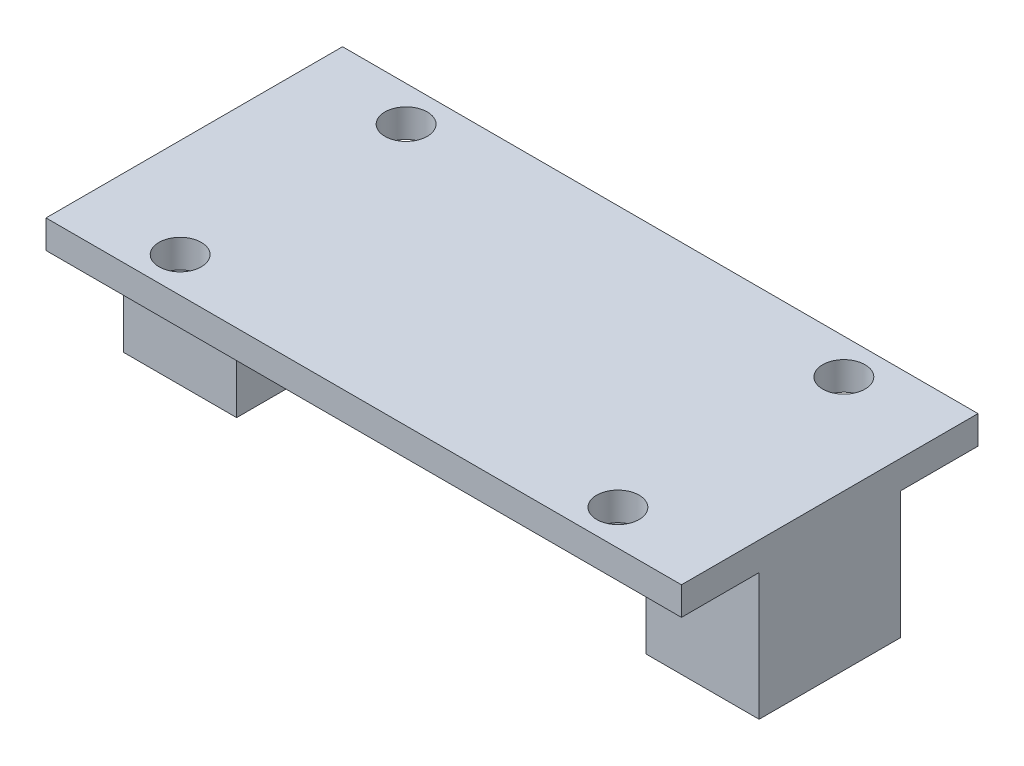
ISO-10303-21;
HEADER;
FILE_DESCRIPTION(('STEP AP214'),'2;1');
FILE_NAME('part.step','',(''),(''),'','','');
FILE_SCHEMA(('AUTOMOTIVE_DESIGN { 1 0 10303 214 1 1 1 1 }'));
ENDSEC;
DATA;
#1=APPLICATION_CONTEXT('core data for automotive mechanical design processes');
#2=APPLICATION_PROTOCOL_DEFINITION('international standard','automotive_design',2000,#1);
#3=PRODUCT_CONTEXT('',#1,'mechanical');
#4=PRODUCT('Part','Part','',(#3));
#5=PRODUCT_RELATED_PRODUCT_CATEGORY('part','',(#4));
#6=PRODUCT_DEFINITION_FORMATION('','',#4);
#7=PRODUCT_DEFINITION_CONTEXT('part definition',#1,'design');
#8=PRODUCT_DEFINITION('design','',#6,#7);
#9=PRODUCT_DEFINITION_SHAPE('','',#8);
#10=(LENGTH_UNIT() NAMED_UNIT(*) SI_UNIT(.MILLI.,.METRE.));
#11=(NAMED_UNIT(*) PLANE_ANGLE_UNIT() SI_UNIT($,.RADIAN.));
#12=(NAMED_UNIT(*) SI_UNIT($,.STERADIAN.) SOLID_ANGLE_UNIT());
#13=UNCERTAINTY_MEASURE_WITH_UNIT(LENGTH_MEASURE(1.E-05),#10,'distance_accuracy_value','');
#14=(GEOMETRIC_REPRESENTATION_CONTEXT(3) GLOBAL_UNCERTAINTY_ASSIGNED_CONTEXT((#13)) GLOBAL_UNIT_ASSIGNED_CONTEXT((#10,
#11,#12)) REPRESENTATION_CONTEXT('',''));
#15=CARTESIAN_POINT('',(0.,0.,0.));
#16=DIRECTION('',(0.,0.,1.));
#17=DIRECTION('',(1.,0.,0.));
#18=AXIS2_PLACEMENT_3D('',#15,#16,#17);
#19=CARTESIAN_POINT('',(17.5,0.,10.));
#20=DIRECTION('',(0.,1.,0.));
#21=DIRECTION('',(-1.,0.,0.));
#22=AXIS2_PLACEMENT_3D('',#19,#20,#21);
#23=PLANE('',#22);
#24=DIRECTION('',(1.,0.,0.));
#25=VECTOR('',#24,1.);
#26=CARTESIAN_POINT('',(17.5,0.,0.));
#27=LINE('',#26,#25);
#28=CARTESIAN_POINT('',(-17.5,0.,0.));
#29=VERTEX_POINT('',#28);
#30=CARTESIAN_POINT('',(17.5,0.,0.));
#31=VERTEX_POINT('',#30);
#32=EDGE_CURVE('E163',#29,#31,#27,.T.);
#33=ORIENTED_EDGE('',*,*,#32,.T.);
#34=DIRECTION('',(0.,0.,-1.));
#35=VECTOR('',#34,1.);
#36=CARTESIAN_POINT('',(17.5,0.,10.));
#37=LINE('',#36,#35);
#38=CARTESIAN_POINT('',(17.5,0.,10.));
#39=VERTEX_POINT('',#38);
#40=EDGE_CURVE('E11',#39,#31,#37,.T.);
#41=ORIENTED_EDGE('',*,*,#40,.F.);
#42=DIRECTION('',(1.,0.,0.));
#43=VECTOR('',#42,1.);
#44=CARTESIAN_POINT('',(17.5,0.,10.));
#45=LINE('',#44,#43);
#46=CARTESIAN_POINT('',(-17.5,0.,10.));
#47=VERTEX_POINT('',#46);
#48=EDGE_CURVE('E200',#47,#39,#45,.T.);
#49=ORIENTED_EDGE('',*,*,#48,.F.);
#50=DIRECTION('',(0.,0.,-1.));
#51=VECTOR('',#50,1.);
#52=CARTESIAN_POINT('',(-17.5,0.,10.));
#53=LINE('',#52,#51);
#54=EDGE_CURVE('E159',#47,#29,#53,.T.);
#55=ORIENTED_EDGE('',*,*,#54,.T.);
#56=EDGE_LOOP('',(#33,#41,#49,#55));
#57=FACE_BOUND('',#56,.T.);
#58=ADVANCED_FACE('F42',(#57),#23,.F.);
#59=CARTESIAN_POINT('',(17.5,-1.,10.));
#60=DIRECTION('',(1.,0.,0.));
#61=DIRECTION('',(0.,0.,-1.));
#62=AXIS2_PLACEMENT_3D('',#59,#60,#61);
#63=PLANE('',#62);
#64=DIRECTION('',(0.,-1.,0.));
#65=VECTOR('',#64,1.);
#66=CARTESIAN_POINT('',(17.5,-1.,0.));
#67=LINE('',#66,#65);
#68=CARTESIAN_POINT('',(17.5,-1.,0.));
#69=VERTEX_POINT('',#68);
#70=EDGE_CURVE('E167',#31,#69,#67,.T.);
#71=ORIENTED_EDGE('',*,*,#70,.T.);
#72=DIRECTION('',(0.,0.,-1.));
#73=VECTOR('',#72,1.);
#74=CARTESIAN_POINT('',(17.5,-1.,10.));
#75=LINE('',#74,#73);
#76=CARTESIAN_POINT('',(17.5,-1.,10.));
#77=VERTEX_POINT('',#76);
#78=EDGE_CURVE('E52',#77,#69,#75,.T.);
#79=ORIENTED_EDGE('',*,*,#78,.F.);
#80=DIRECTION('',(0.,-1.,0.));
#81=VECTOR('',#80,1.);
#82=CARTESIAN_POINT('',(17.5,-1.,10.));
#83=LINE('',#82,#81);
#84=EDGE_CURVE('E111',#39,#77,#83,.T.);
#85=ORIENTED_EDGE('',*,*,#84,.F.);
#86=ORIENTED_EDGE('',*,*,#40,.T.);
#87=EDGE_LOOP('',(#71,#79,#85,#86));
#88=FACE_BOUND('',#87,.T.);
#89=ADVANCED_FACE('F405',(#88),#63,.F.);
#90=CARTESIAN_POINT('',(14.5,-1.,10.));
#91=DIRECTION('',(0.,-1.,0.));
#92=DIRECTION('',(0.,0.,-1.));
#93=AXIS2_PLACEMENT_3D('',#90,#91,#92);
#94=PLANE('',#93);
#95=DIRECTION('',(-1.,0.,0.));
#96=VECTOR('',#95,1.);
#97=CARTESIAN_POINT('',(14.5,-1.,0.));
#98=LINE('',#97,#96);
#99=CARTESIAN_POINT('',(14.5,-1.,0.));
#100=VERTEX_POINT('',#99);
#101=EDGE_CURVE('E171',#69,#100,#98,.T.);
#102=ORIENTED_EDGE('',*,*,#101,.T.);
#103=DIRECTION('',(0.,0.,-1.));
#104=VECTOR('',#103,1.);
#105=CARTESIAN_POINT('',(14.5,-1.,10.));
#106=LINE('',#105,#104);
#107=CARTESIAN_POINT('',(14.5,-1.,10.));
#108=VERTEX_POINT('',#107);
#109=EDGE_CURVE('E219',#108,#100,#106,.T.);
#110=ORIENTED_EDGE('',*,*,#109,.F.);
#111=DIRECTION('',(-1.,0.,0.));
#112=VECTOR('',#111,1.);
#113=CARTESIAN_POINT('',(14.5,-1.,10.));
#114=LINE('',#113,#112);
#115=EDGE_CURVE('E308',#77,#108,#114,.T.);
#116=ORIENTED_EDGE('',*,*,#115,.F.);
#117=ORIENTED_EDGE('',*,*,#78,.T.);
#118=EDGE_LOOP('',(#102,#110,#116,#117));
#119=FACE_BOUND('',#118,.T.);
#120=ADVANCED_FACE('F403',(#119),#94,.F.);
#121=CARTESIAN_POINT('',(14.5,-5.,10.));
#122=DIRECTION('',(1.,0.,0.));
#123=DIRECTION('',(0.,0.,-1.));
#124=AXIS2_PLACEMENT_3D('',#121,#122,#123);
#125=PLANE('',#124);
#126=DIRECTION('',(0.,-1.,0.));
#127=VECTOR('',#126,1.);
#128=CARTESIAN_POINT('',(14.5,-5.,0.));
#129=LINE('',#128,#127);
#130=CARTESIAN_POINT('',(14.5,-5.,0.));
#131=VERTEX_POINT('',#130);
#132=EDGE_CURVE('E174',#100,#131,#129,.T.);
#133=ORIENTED_EDGE('',*,*,#132,.T.);
#134=DIRECTION('',(0.,0.,-1.));
#135=VECTOR('',#134,1.);
#136=CARTESIAN_POINT('',(14.5,-5.,10.));
#137=LINE('',#136,#135);
#138=CARTESIAN_POINT('',(14.5,-5.,10.));
#139=VERTEX_POINT('',#138);
#140=EDGE_CURVE('E215',#139,#131,#137,.T.);
#141=ORIENTED_EDGE('',*,*,#140,.F.);
#142=DIRECTION('',(0.,-1.,0.));
#143=VECTOR('',#142,1.);
#144=CARTESIAN_POINT('',(14.5,-5.,10.));
#145=LINE('',#144,#143);
#146=EDGE_CURVE('E311',#108,#139,#145,.T.);
#147=ORIENTED_EDGE('',*,*,#146,.F.);
#148=ORIENTED_EDGE('',*,*,#109,.T.);
#149=EDGE_LOOP('',(#133,#141,#147,#148));
#150=FACE_BOUND('',#149,.T.);
#151=ADVANCED_FACE('F399',(#150),#125,.F.);
#152=CARTESIAN_POINT('',(22.5,-5.,10.));
#153=DIRECTION('',(0.,1.,0.));
#154=DIRECTION('',(-1.,0.,0.));
#155=AXIS2_PLACEMENT_3D('',#152,#153,#154);
#156=PLANE('',#155);
#157=DIRECTION('',(1.,0.,0.));
#158=VECTOR('',#157,1.);
#159=CARTESIAN_POINT('',(22.5,-5.,0.));
#160=LINE('',#159,#158);
#161=CARTESIAN_POINT('',(22.5,-5.,0.));
#162=VERTEX_POINT('',#161);
#163=EDGE_CURVE('E177',#131,#162,#160,.T.);
#164=ORIENTED_EDGE('',*,*,#163,.T.);
#165=DIRECTION('',(0.,0.,-1.));
#166=VECTOR('',#165,1.);
#167=CARTESIAN_POINT('',(22.5,-5.,10.));
#168=LINE('',#167,#166);
#169=CARTESIAN_POINT('',(22.5,-5.,10.));
#170=VERTEX_POINT('',#169);
#171=EDGE_CURVE('E211',#170,#162,#168,.T.);
#172=ORIENTED_EDGE('',*,*,#171,.F.);
#173=DIRECTION('',(1.,0.,0.));
#174=VECTOR('',#173,1.);
#175=CARTESIAN_POINT('',(22.5,-5.,10.));
#176=LINE('',#175,#174);
#177=EDGE_CURVE('E314',#139,#170,#176,.T.);
#178=ORIENTED_EDGE('',*,*,#177,.F.);
#179=ORIENTED_EDGE('',*,*,#140,.T.);
#180=EDGE_LOOP('',(#164,#172,#178,#179));
#181=FACE_BOUND('',#180,.T.);
#182=ADVANCED_FACE('F395',(#181),#156,.F.);
#183=CARTESIAN_POINT('',(22.5,4.,10.));
#184=DIRECTION('',(-1.,0.,0.));
#185=DIRECTION('',(0.,0.,1.));
#186=AXIS2_PLACEMENT_3D('',#183,#184,#185);
#187=PLANE('',#186);
#188=DIRECTION('',(0.,1.,0.));
#189=VECTOR('',#188,1.);
#190=CARTESIAN_POINT('',(22.5,4.,0.));
#191=LINE('',#190,#189);
#192=CARTESIAN_POINT('',(22.5,4.,0.));
#193=VERTEX_POINT('',#192);
#194=EDGE_CURVE('E180',#162,#193,#191,.T.);
#195=ORIENTED_EDGE('',*,*,#194,.T.);
#196=DIRECTION('',(0.,0.,-1.));
#197=VECTOR('',#196,1.);
#198=CARTESIAN_POINT('',(22.5,4.,15.5));
#199=LINE('',#198,#197);
#200=CARTESIAN_POINT('',(22.5,4.,-5.5));
#201=VERTEX_POINT('',#200);
#202=EDGE_CURVE('E255',#193,#201,#199,.T.);
#203=ORIENTED_EDGE('',*,*,#202,.T.);
#204=DIRECTION('',(0.,-1.,0.));
#205=VECTOR('',#204,1.);
#206=CARTESIAN_POINT('',(22.5,6.,-5.5));
#207=LINE('',#206,#205);
#208=CARTESIAN_POINT('',(22.5,6.,-5.5));
#209=VERTEX_POINT('',#208);
#210=EDGE_CURVE('E168',#209,#201,#207,.T.);
#211=ORIENTED_EDGE('',*,*,#210,.F.);
#212=DIRECTION('',(0.,0.,-1.));
#213=VECTOR('',#212,1.);
#214=CARTESIAN_POINT('',(22.5,6.,15.5));
#215=LINE('',#214,#213);
#216=CARTESIAN_POINT('',(22.5,6.,15.5));
#217=VERTEX_POINT('',#216);
#218=EDGE_CURVE('E256',#217,#209,#215,.T.);
#219=ORIENTED_EDGE('',*,*,#218,.F.);
#220=DIRECTION('',(0.,-1.,0.));
#221=VECTOR('',#220,1.);
#222=CARTESIAN_POINT('',(22.5,6.,15.5));
#223=LINE('',#222,#221);
#224=CARTESIAN_POINT('',(22.5,4.,15.5));
#225=VERTEX_POINT('',#224);
#226=EDGE_CURVE('E273',#217,#225,#223,.T.);
#227=ORIENTED_EDGE('',*,*,#226,.T.);
#228=CARTESIAN_POINT('',(22.5,4.,10.));
#229=VERTEX_POINT('',#228);
#230=EDGE_CURVE('E274',#225,#229,#199,.T.);
#231=ORIENTED_EDGE('',*,*,#230,.T.);
#232=DIRECTION('',(0.,1.,0.));
#233=VECTOR('',#232,1.);
#234=CARTESIAN_POINT('',(22.5,4.,10.));
#235=LINE('',#234,#233);
#236=EDGE_CURVE('E317',#170,#229,#235,.T.);
#237=ORIENTED_EDGE('',*,*,#236,.F.);
#238=ORIENTED_EDGE('',*,*,#171,.T.);
#239=EDGE_LOOP('',(#195,#203,#211,#219,#227,#231,#237,#238));
#240=FACE_BOUND('',#239,.T.);
#241=ADVANCED_FACE('F337',(#240),#187,.F.);
#242=CARTESIAN_POINT('',(-22.5,-5.,10.));
#243=DIRECTION('',(1.,0.,0.));
#244=DIRECTION('',(0.,0.,-1.));
#245=AXIS2_PLACEMENT_3D('',#242,#243,#244);
#246=PLANE('',#245);
#247=DIRECTION('',(0.,-1.,0.));
#248=VECTOR('',#247,1.);
#249=CARTESIAN_POINT('',(-22.5,-5.,0.));
#250=LINE('',#249,#248);
#251=CARTESIAN_POINT('',(-22.5,4.,0.));
#252=VERTEX_POINT('',#251);
#253=CARTESIAN_POINT('',(-22.5,-5.,0.));
#254=VERTEX_POINT('',#253);
#255=EDGE_CURVE('E188',#252,#254,#250,.T.);
#256=ORIENTED_EDGE('',*,*,#255,.T.);
#257=DIRECTION('',(0.,0.,-1.));
#258=VECTOR('',#257,1.);
#259=CARTESIAN_POINT('',(-22.5,-5.,10.));
#260=LINE('',#259,#258);
#261=CARTESIAN_POINT('',(-22.5,-5.,10.));
#262=VERTEX_POINT('',#261);
#263=EDGE_CURVE('E207',#262,#254,#260,.T.);
#264=ORIENTED_EDGE('',*,*,#263,.F.);
#265=DIRECTION('',(0.,-1.,0.));
#266=VECTOR('',#265,1.);
#267=CARTESIAN_POINT('',(-22.5,0.,10.));
#268=LINE('',#267,#266);
#269=CARTESIAN_POINT('',(-22.5,4.,10.));
#270=VERTEX_POINT('',#269);
#271=EDGE_CURVE('E325',#270,#262,#268,.T.);
#272=ORIENTED_EDGE('',*,*,#271,.F.);
#273=DIRECTION('',(0.,0.,1.));
#274=VECTOR('',#273,1.);
#275=CARTESIAN_POINT('',(-22.5,4.,15.5));
#276=LINE('',#275,#274);
#277=CARTESIAN_POINT('',(-22.5,4.,15.5));
#278=VERTEX_POINT('',#277);
#279=EDGE_CURVE('E282',#270,#278,#276,.T.);
#280=ORIENTED_EDGE('',*,*,#279,.T.);
#281=DIRECTION('',(0.,-1.,0.));
#282=VECTOR('',#281,1.);
#283=CARTESIAN_POINT('',(-22.5,6.,15.5));
#284=LINE('',#283,#282);
#285=CARTESIAN_POINT('',(-22.5,6.,15.5));
#286=VERTEX_POINT('',#285);
#287=EDGE_CURVE('E293',#286,#278,#284,.T.);
#288=ORIENTED_EDGE('',*,*,#287,.F.);
#289=DIRECTION('',(0.,0.,1.));
#290=VECTOR('',#289,1.);
#291=CARTESIAN_POINT('',(-22.5,6.,15.5));
#292=LINE('',#291,#290);
#293=CARTESIAN_POINT('',(-22.5,6.,-5.5));
#294=VERTEX_POINT('',#293);
#295=EDGE_CURVE('E265',#294,#286,#292,.T.);
#296=ORIENTED_EDGE('',*,*,#295,.F.);
#297=DIRECTION('',(0.,-1.,0.));
#298=VECTOR('',#297,1.);
#299=CARTESIAN_POINT('',(-22.5,6.,-5.5));
#300=LINE('',#299,#298);
#301=CARTESIAN_POINT('',(-22.5,4.,-5.5));
#302=VERTEX_POINT('',#301);
#303=EDGE_CURVE('E297',#294,#302,#300,.T.);
#304=ORIENTED_EDGE('',*,*,#303,.T.);
#305=EDGE_CURVE('E283',#302,#252,#276,.T.);
#306=ORIENTED_EDGE('',*,*,#305,.T.);
#307=EDGE_LOOP('',(#256,#264,#272,#280,#288,#296,#304,#306));
#308=FACE_BOUND('',#307,.T.);
#309=ADVANCED_FACE('F376',(#308),#246,.F.);
#310=CARTESIAN_POINT('',(-14.5,-5.,10.));
#311=DIRECTION('',(0.,1.,0.));
#312=DIRECTION('',(0.,0.,1.));
#313=AXIS2_PLACEMENT_3D('',#310,#311,#312);
#314=PLANE('',#313);
#315=DIRECTION('',(1.,0.,0.));
#316=VECTOR('',#315,1.);
#317=CARTESIAN_POINT('',(-14.5,-5.,0.));
#318=LINE('',#317,#316);
#319=CARTESIAN_POINT('',(-14.5,-5.,0.));
#320=VERTEX_POINT('',#319);
#321=EDGE_CURVE('E191',#254,#320,#318,.T.);
#322=ORIENTED_EDGE('',*,*,#321,.T.);
#323=DIRECTION('',(0.,0.,-1.));
#324=VECTOR('',#323,1.);
#325=CARTESIAN_POINT('',(-14.5,-5.,10.));
#326=LINE('',#325,#324);
#327=CARTESIAN_POINT('',(-14.5,-5.,10.));
#328=VERTEX_POINT('',#327);
#329=EDGE_CURVE('E152',#328,#320,#326,.T.);
#330=ORIENTED_EDGE('',*,*,#329,.F.);
#331=DIRECTION('',(1.,0.,0.));
#332=VECTOR('',#331,1.);
#333=CARTESIAN_POINT('',(-14.5,-5.,10.));
#334=LINE('',#333,#332);
#335=EDGE_CURVE('E141',#262,#328,#334,.T.);
#336=ORIENTED_EDGE('',*,*,#335,.F.);
#337=ORIENTED_EDGE('',*,*,#263,.T.);
#338=EDGE_LOOP('',(#322,#330,#336,#337));
#339=FACE_BOUND('',#338,.T.);
#340=ADVANCED_FACE('F382',(#339),#314,.F.);
#341=CARTESIAN_POINT('',(-14.5,-1.,10.));
#342=DIRECTION('',(-1.,0.,0.));
#343=DIRECTION('',(0.,0.,1.));
#344=AXIS2_PLACEMENT_3D('',#341,#342,#343);
#345=PLANE('',#344);
#346=DIRECTION('',(0.,1.,0.));
#347=VECTOR('',#346,1.);
#348=CARTESIAN_POINT('',(-14.5,-1.,0.));
#349=LINE('',#348,#347);
#350=CARTESIAN_POINT('',(-14.5,-1.,0.));
#351=VERTEX_POINT('',#350);
#352=EDGE_CURVE('E150',#320,#351,#349,.T.);
#353=ORIENTED_EDGE('',*,*,#352,.T.);
#354=DIRECTION('',(0.,0.,-1.));
#355=VECTOR('',#354,1.);
#356=CARTESIAN_POINT('',(-14.5,-1.,10.));
#357=LINE('',#356,#355);
#358=CARTESIAN_POINT('',(-14.5,-1.,10.));
#359=VERTEX_POINT('',#358);
#360=EDGE_CURVE('E147',#359,#351,#357,.T.);
#361=ORIENTED_EDGE('',*,*,#360,.F.);
#362=DIRECTION('',(0.,1.,0.));
#363=VECTOR('',#362,1.);
#364=CARTESIAN_POINT('',(-14.5,-1.,10.));
#365=LINE('',#364,#363);
#366=EDGE_CURVE('E135',#328,#359,#365,.T.);
#367=ORIENTED_EDGE('',*,*,#366,.F.);
#368=ORIENTED_EDGE('',*,*,#329,.T.);
#369=EDGE_LOOP('',(#353,#361,#367,#368));
#370=FACE_BOUND('',#369,.T.);
#371=ADVANCED_FACE('F148',(#370),#345,.F.);
#372=CARTESIAN_POINT('',(-17.5,-1.,10.));
#373=DIRECTION('',(0.,-1.,0.));
#374=DIRECTION('',(0.,0.,-1.));
#375=AXIS2_PLACEMENT_3D('',#372,#373,#374);
#376=PLANE('',#375);
#377=DIRECTION('',(-1.,0.,0.));
#378=VECTOR('',#377,1.);
#379=CARTESIAN_POINT('',(-17.5,-1.,0.));
#380=LINE('',#379,#378);
#381=CARTESIAN_POINT('',(-17.5,-1.,0.));
#382=VERTEX_POINT('',#381);
#383=EDGE_CURVE('E97',#351,#382,#380,.T.);
#384=ORIENTED_EDGE('',*,*,#383,.T.);
#385=DIRECTION('',(0.,0.,-1.));
#386=VECTOR('',#385,1.);
#387=CARTESIAN_POINT('',(-17.5,-1.,10.));
#388=LINE('',#387,#386);
#389=CARTESIAN_POINT('',(-17.5,-1.,10.));
#390=VERTEX_POINT('',#389);
#391=EDGE_CURVE('E153',#390,#382,#388,.T.);
#392=ORIENTED_EDGE('',*,*,#391,.F.);
#393=DIRECTION('',(-1.,0.,0.));
#394=VECTOR('',#393,1.);
#395=CARTESIAN_POINT('',(-17.5,-1.,10.));
#396=LINE('',#395,#394);
#397=EDGE_CURVE('E139',#359,#390,#396,.T.);
#398=ORIENTED_EDGE('',*,*,#397,.F.);
#399=ORIENTED_EDGE('',*,*,#360,.T.);
#400=EDGE_LOOP('',(#384,#392,#398,#399));
#401=FACE_BOUND('',#400,.T.);
#402=ADVANCED_FACE('F155',(#401),#376,.F.);
#403=CARTESIAN_POINT('',(-17.5,0.,10.));
#404=DIRECTION('',(-1.,0.,0.));
#405=DIRECTION('',(0.,0.,1.));
#406=AXIS2_PLACEMENT_3D('',#403,#404,#405);
#407=PLANE('',#406);
#408=DIRECTION('',(0.,1.,0.));
#409=VECTOR('',#408,1.);
#410=CARTESIAN_POINT('',(-17.5,0.,0.));
#411=LINE('',#410,#409);
#412=EDGE_CURVE('E103',#382,#29,#411,.T.);
#413=ORIENTED_EDGE('',*,*,#412,.T.);
#414=ORIENTED_EDGE('',*,*,#54,.F.);
#415=DIRECTION('',(0.,1.,0.));
#416=VECTOR('',#415,1.);
#417=CARTESIAN_POINT('',(-17.5,0.,10.));
#418=LINE('',#417,#416);
#419=EDGE_CURVE('E61',#390,#47,#418,.T.);
#420=ORIENTED_EDGE('',*,*,#419,.F.);
#421=ORIENTED_EDGE('',*,*,#391,.T.);
#422=EDGE_LOOP('',(#413,#414,#420,#421));
#423=FACE_BOUND('',#422,.T.);
#424=ADVANCED_FACE('F408',(#423),#407,.F.);
#425=CARTESIAN_POINT('',(0.,0.,10.));
#426=DIRECTION('',(0.,0.,1.));
#427=DIRECTION('',(1.,0.,0.));
#428=AXIS2_PLACEMENT_3D('',#425,#426,#427);
#429=PLANE('',#428);
#430=ORIENTED_EDGE('',*,*,#48,.T.);
#431=ORIENTED_EDGE('',*,*,#84,.T.);
#432=ORIENTED_EDGE('',*,*,#115,.T.);
#433=ORIENTED_EDGE('',*,*,#146,.T.);
#434=ORIENTED_EDGE('',*,*,#177,.T.);
#435=ORIENTED_EDGE('',*,*,#236,.T.);
#436=DIRECTION('',(-1.,0.,0.));
#437=VECTOR('',#436,1.);
#438=CARTESIAN_POINT('',(-22.5,4.,10.));
#439=LINE('',#438,#437);
#440=EDGE_CURVE('E321',#229,#270,#439,.T.);
#441=ORIENTED_EDGE('',*,*,#440,.T.);
#442=ORIENTED_EDGE('',*,*,#271,.T.);
#443=ORIENTED_EDGE('',*,*,#335,.T.);
#444=ORIENTED_EDGE('',*,*,#366,.T.);
#445=ORIENTED_EDGE('',*,*,#397,.T.);
#446=ORIENTED_EDGE('',*,*,#419,.T.);
#447=EDGE_LOOP('',(#430,#431,#432,#433,#434,#435,#441,#442,#443,#444,#445,#446));
#448=FACE_BOUND('',#447,.T.);
#449=ADVANCED_FACE('F137',(#448),#429,.T.);
#450=CARTESIAN_POINT('',(0.,0.,0.));
#451=DIRECTION('',(0.,0.,1.));
#452=DIRECTION('',(1.,0.,0.));
#453=AXIS2_PLACEMENT_3D('',#450,#451,#452);
#454=PLANE('',#453);
#455=ORIENTED_EDGE('',*,*,#32,.F.);
#456=ORIENTED_EDGE('',*,*,#412,.F.);
#457=ORIENTED_EDGE('',*,*,#383,.F.);
#458=ORIENTED_EDGE('',*,*,#352,.F.);
#459=ORIENTED_EDGE('',*,*,#321,.F.);
#460=ORIENTED_EDGE('',*,*,#255,.F.);
#461=DIRECTION('',(-1.,0.,0.));
#462=VECTOR('',#461,1.);
#463=CARTESIAN_POINT('',(-22.5,4.,0.));
#464=LINE('',#463,#462);
#465=EDGE_CURVE('E184',#193,#252,#464,.T.);
#466=ORIENTED_EDGE('',*,*,#465,.F.);
#467=ORIENTED_EDGE('',*,*,#194,.F.);
#468=ORIENTED_EDGE('',*,*,#163,.F.);
#469=ORIENTED_EDGE('',*,*,#132,.F.);
#470=ORIENTED_EDGE('',*,*,#101,.F.);
#471=ORIENTED_EDGE('',*,*,#70,.F.);
#472=EDGE_LOOP('',(#455,#456,#457,#458,#459,#460,#466,#467,#468,#469,#470,#471));
#473=FACE_BOUND('',#472,.T.);
#474=ADVANCED_FACE('F380',(#473),#454,.F.);
#475=CARTESIAN_POINT('',(0.,4.,0.));
#476=DIRECTION('',(0.,-1.,0.));
#477=DIRECTION('',(1.,0.,0.));
#478=AXIS2_PLACEMENT_3D('',#475,#476,#477);
#479=PLANE('',#478);
#480=CARTESIAN_POINT('',(15.5,4.,13.));
#481=DIRECTION('',(0.,-1.,0.));
#482=DIRECTION('',(1.,0.,0.));
#483=AXIS2_PLACEMENT_3D('',#480,#481,#482);
#484=CIRCLE('',#483,1.5);
#485=CARTESIAN_POINT('',(17.,4.,13.));
#486=VERTEX_POINT('',#485);
#487=EDGE_CURVE('E251',#486,#486,#484,.T.);
#488=ORIENTED_EDGE('',*,*,#487,.F.);
#489=EDGE_LOOP('',(#488));
#490=FACE_BOUND('',#489,.T.);
#491=CARTESIAN_POINT('',(-15.5,4.,13.));
#492=DIRECTION('',(0.,-1.,0.));
#493=DIRECTION('',(1.,0.,0.));
#494=AXIS2_PLACEMENT_3D('',#491,#492,#493);
#495=CIRCLE('',#494,1.5);
#496=CARTESIAN_POINT('',(-14.,4.,13.));
#497=VERTEX_POINT('',#496);
#498=EDGE_CURVE('E234',#497,#497,#495,.T.);
#499=ORIENTED_EDGE('',*,*,#498,.F.);
#500=EDGE_LOOP('',(#499));
#501=FACE_BOUND('',#500,.T.);
#502=ORIENTED_EDGE('',*,*,#440,.F.);
#503=ORIENTED_EDGE('',*,*,#230,.F.);
#504=DIRECTION('',(1.,0.,0.));
#505=VECTOR('',#504,1.);
#506=CARTESIAN_POINT('',(-22.5,4.,15.5));
#507=LINE('',#506,#505);
#508=EDGE_CURVE('E261',#278,#225,#507,.T.);
#509=ORIENTED_EDGE('',*,*,#508,.F.);
#510=ORIENTED_EDGE('',*,*,#279,.F.);
#511=EDGE_LOOP('',(#502,#503,#509,#510));
#512=FACE_BOUND('',#511,.T.);
#513=ADVANCED_FACE('F387',(#490,#501,#512),#479,.T.);
#514=CARTESIAN_POINT('',(-22.5,6.,-5.5));
#515=DIRECTION('',(0.,0.,1.));
#516=DIRECTION('',(1.,0.,0.));
#517=AXIS2_PLACEMENT_3D('',#514,#515,#516);
#518=PLANE('',#517);
#519=DIRECTION('',(-1.,0.,0.));
#520=VECTOR('',#519,1.);
#521=CARTESIAN_POINT('',(-22.5,4.,-5.5));
#522=LINE('',#521,#520);
#523=EDGE_CURVE('E278',#201,#302,#522,.T.);
#524=ORIENTED_EDGE('',*,*,#523,.T.);
#525=ORIENTED_EDGE('',*,*,#303,.F.);
#526=DIRECTION('',(-1.,0.,0.));
#527=VECTOR('',#526,1.);
#528=CARTESIAN_POINT('',(-22.5,6.,-5.5));
#529=LINE('',#528,#527);
#530=EDGE_CURVE('E260',#209,#294,#529,.T.);
#531=ORIENTED_EDGE('',*,*,#530,.F.);
#532=ORIENTED_EDGE('',*,*,#210,.T.);
#533=EDGE_LOOP('',(#524,#525,#531,#532));
#534=FACE_BOUND('',#533,.T.);
#535=ADVANCED_FACE('F351',(#534),#518,.F.);
#536=CARTESIAN_POINT('',(-22.5,6.,15.5));
#537=DIRECTION('',(0.,0.,-1.));
#538=DIRECTION('',(-1.,0.,0.));
#539=AXIS2_PLACEMENT_3D('',#536,#537,#538);
#540=PLANE('',#539);
#541=ORIENTED_EDGE('',*,*,#508,.T.);
#542=ORIENTED_EDGE('',*,*,#226,.F.);
#543=DIRECTION('',(1.,0.,0.));
#544=VECTOR('',#543,1.);
#545=CARTESIAN_POINT('',(-22.5,6.,15.5));
#546=LINE('',#545,#544);
#547=EDGE_CURVE('E269',#286,#217,#546,.T.);
#548=ORIENTED_EDGE('',*,*,#547,.F.);
#549=ORIENTED_EDGE('',*,*,#287,.T.);
#550=EDGE_LOOP('',(#541,#542,#548,#549));
#551=FACE_BOUND('',#550,.T.);
#552=ADVANCED_FACE('F492',(#551),#540,.F.);
#553=CARTESIAN_POINT('',(0.,6.,0.));
#554=DIRECTION('',(0.,-1.,0.));
#555=DIRECTION('',(1.,0.,0.));
#556=AXIS2_PLACEMENT_3D('',#553,#554,#555);
#557=PLANE('',#556);
#558=CARTESIAN_POINT('',(15.5,6.,13.));
#559=DIRECTION('',(0.,1.,0.));
#560=DIRECTION('',(-1.,0.,0.));
#561=AXIS2_PLACEMENT_3D('',#558,#559,#560);
#562=CIRCLE('',#561,1.5);
#563=CARTESIAN_POINT('',(14.,6.,13.));
#564=VERTEX_POINT('',#563);
#565=EDGE_CURVE('E246',#564,#564,#562,.T.);
#566=ORIENTED_EDGE('',*,*,#565,.F.);
#567=EDGE_LOOP('',(#566));
#568=FACE_BOUND('',#567,.T.);
#569=CARTESIAN_POINT('',(15.5,6.,-3.));
#570=DIRECTION('',(0.,1.,0.));
#571=DIRECTION('',(-1.,0.,0.));
#572=AXIS2_PLACEMENT_3D('',#569,#570,#571);
#573=CIRCLE('',#572,1.5);
#574=CARTESIAN_POINT('',(14.,6.,-3.));
#575=VERTEX_POINT('',#574);
#576=EDGE_CURVE('E242',#575,#575,#573,.T.);
#577=ORIENTED_EDGE('',*,*,#576,.F.);
#578=EDGE_LOOP('',(#577));
#579=FACE_BOUND('',#578,.T.);
#580=CARTESIAN_POINT('',(-15.5,6.,-3.));
#581=DIRECTION('',(0.,1.,0.));
#582=DIRECTION('',(-1.,0.,0.));
#583=AXIS2_PLACEMENT_3D('',#580,#581,#582);
#584=CIRCLE('',#583,1.5);
#585=CARTESIAN_POINT('',(-17.,6.,-3.));
#586=VERTEX_POINT('',#585);
#587=EDGE_CURVE('E236',#586,#586,#584,.T.);
#588=ORIENTED_EDGE('',*,*,#587,.F.);
#589=EDGE_LOOP('',(#588));
#590=FACE_BOUND('',#589,.T.);
#591=CARTESIAN_POINT('',(-15.5,6.,13.));
#592=DIRECTION('',(0.,1.,0.));
#593=DIRECTION('',(-1.,0.,0.));
#594=AXIS2_PLACEMENT_3D('',#591,#592,#593);
#595=CIRCLE('',#594,1.5);
#596=CARTESIAN_POINT('',(-17.,6.,13.));
#597=VERTEX_POINT('',#596);
#598=EDGE_CURVE('E228',#597,#597,#595,.T.);
#599=ORIENTED_EDGE('',*,*,#598,.F.);
#600=EDGE_LOOP('',(#599));
#601=FACE_BOUND('',#600,.T.);
#602=ORIENTED_EDGE('',*,*,#218,.T.);
#603=ORIENTED_EDGE('',*,*,#530,.T.);
#604=ORIENTED_EDGE('',*,*,#295,.T.);
#605=ORIENTED_EDGE('',*,*,#547,.T.);
#606=EDGE_LOOP('',(#602,#603,#604,#605));
#607=FACE_BOUND('',#606,.T.);
#608=ADVANCED_FACE('F357',(#568,#579,#590,#601,#607),#557,.F.);
#609=CARTESIAN_POINT('',(15.5,4.,-3.));
#610=DIRECTION('',(0.,-1.,0.));
#611=DIRECTION('',(1.,0.,0.));
#612=AXIS2_PLACEMENT_3D('',#609,#610,#611);
#613=CIRCLE('',#612,1.5);
#614=CARTESIAN_POINT('',(17.,4.,-3.));
#615=VERTEX_POINT('',#614);
#616=EDGE_CURVE('E45',#615,#615,#613,.T.);
#617=ORIENTED_EDGE('',*,*,#616,.F.);
#618=EDGE_LOOP('',(#617));
#619=FACE_BOUND('',#618,.T.);
#620=CARTESIAN_POINT('',(-15.5,4.,-3.));
#621=DIRECTION('',(0.,-1.,0.));
#622=DIRECTION('',(1.,0.,0.));
#623=AXIS2_PLACEMENT_3D('',#620,#621,#622);
#624=CIRCLE('',#623,1.5);
#625=CARTESIAN_POINT('',(-14.,4.,-3.));
#626=VERTEX_POINT('',#625);
#627=EDGE_CURVE('E225',#626,#626,#624,.T.);
#628=ORIENTED_EDGE('',*,*,#627,.F.);
#629=EDGE_LOOP('',(#628));
#630=FACE_BOUND('',#629,.T.);
#631=ORIENTED_EDGE('',*,*,#202,.F.);
#632=ORIENTED_EDGE('',*,*,#465,.T.);
#633=ORIENTED_EDGE('',*,*,#305,.F.);
#634=ORIENTED_EDGE('',*,*,#523,.F.);
#635=EDGE_LOOP('',(#631,#632,#633,#634));
#636=FACE_BOUND('',#635,.T.);
#637=ADVANCED_FACE('F347',(#619,#630,#636),#479,.T.);
#638=CARTESIAN_POINT('',(-15.5,0.999999999999999,-3.));
#639=DIRECTION('',(0.,1.,0.));
#640=DIRECTION('',(-1.,0.,0.));
#641=AXIS2_PLACEMENT_3D('',#638,#639,#640);
#642=CYLINDRICAL_SURFACE('',#641,1.5);
#643=ORIENTED_EDGE('',*,*,#627,.T.);
#644=EDGE_LOOP('',(#643));
#645=FACE_BOUND('',#644,.T.);
#646=ORIENTED_EDGE('',*,*,#587,.T.);
#647=EDGE_LOOP('',(#646));
#648=FACE_BOUND('',#647,.T.);
#649=ADVANCED_FACE('F530',(#645,#648),#642,.F.);
#650=CARTESIAN_POINT('',(15.5,1.,-3.));
#651=DIRECTION('',(0.,1.,0.));
#652=DIRECTION('',(-1.,0.,0.));
#653=AXIS2_PLACEMENT_3D('',#650,#651,#652);
#654=CYLINDRICAL_SURFACE('',#653,1.5);
#655=ORIENTED_EDGE('',*,*,#616,.T.);
#656=EDGE_LOOP('',(#655));
#657=FACE_BOUND('',#656,.T.);
#658=ORIENTED_EDGE('',*,*,#576,.T.);
#659=EDGE_LOOP('',(#658));
#660=FACE_BOUND('',#659,.T.);
#661=ADVANCED_FACE('F540',(#657,#660),#654,.F.);
#662=CARTESIAN_POINT('',(-15.5,0.999999999999999,13.));
#663=DIRECTION('',(0.,1.,0.));
#664=DIRECTION('',(-1.,0.,0.));
#665=AXIS2_PLACEMENT_3D('',#662,#663,#664);
#666=CYLINDRICAL_SURFACE('',#665,1.5);
#667=ORIENTED_EDGE('',*,*,#498,.T.);
#668=EDGE_LOOP('',(#667));
#669=FACE_BOUND('',#668,.T.);
#670=ORIENTED_EDGE('',*,*,#598,.T.);
#671=EDGE_LOOP('',(#670));
#672=FACE_BOUND('',#671,.T.);
#673=ADVANCED_FACE('F550',(#669,#672),#666,.F.);
#674=CARTESIAN_POINT('',(15.5,1.,13.));
#675=DIRECTION('',(0.,1.,0.));
#676=DIRECTION('',(-1.,0.,0.));
#677=AXIS2_PLACEMENT_3D('',#674,#675,#676);
#678=CYLINDRICAL_SURFACE('',#677,1.5);
#679=ORIENTED_EDGE('',*,*,#487,.T.);
#680=EDGE_LOOP('',(#679));
#681=FACE_BOUND('',#680,.T.);
#682=ORIENTED_EDGE('',*,*,#565,.T.);
#683=EDGE_LOOP('',(#682));
#684=FACE_BOUND('',#683,.T.);
#685=ADVANCED_FACE('F561',(#681,#684),#678,.F.);
#686=CLOSED_SHELL('',(#58,#89,#120,#151,#182,#241,#309,#340,#371,#402,#424,#449,#474,#513,#535,
#552,#608,#637,#649,#661,#673,#685));
#687=MANIFOLD_SOLID_BREP('B2',#686);
#688=ADVANCED_BREP_SHAPE_REPRESENTATION('',(#18,#687),#14);
#689=SHAPE_DEFINITION_REPRESENTATION(#9,#688);
ENDSEC;
END-ISO-10303-21;
